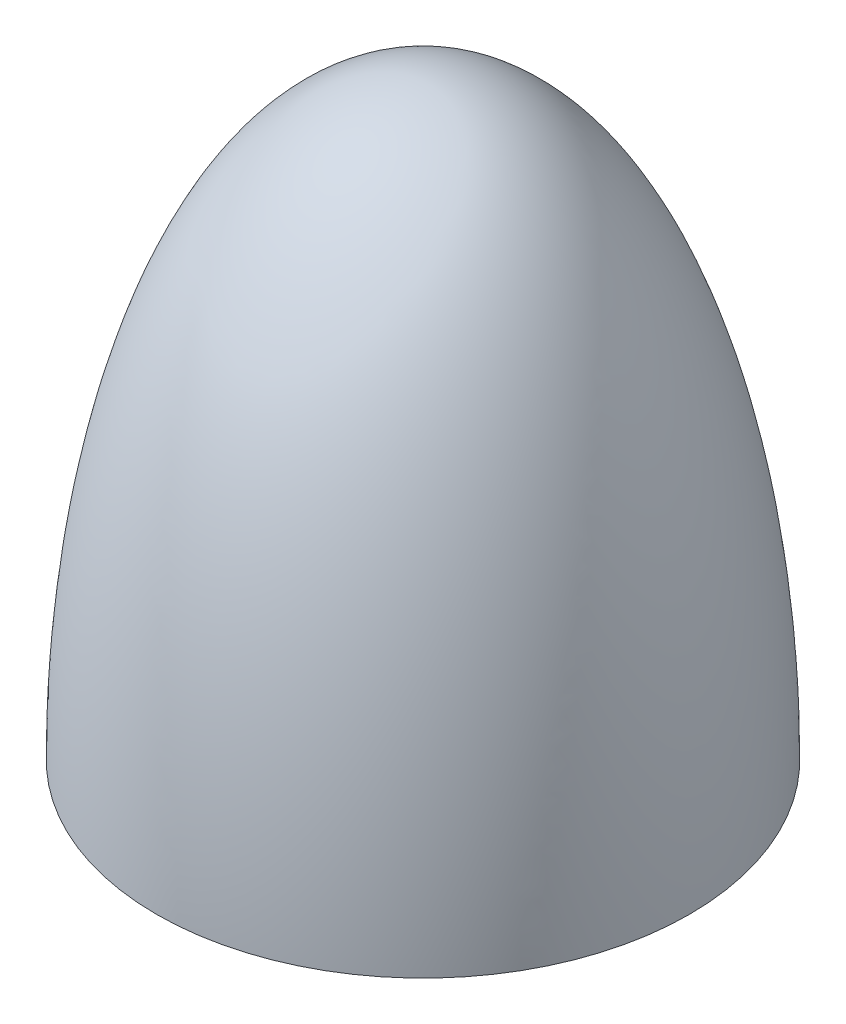
ISO-10303-21;
HEADER;
FILE_DESCRIPTION(('STEP AP214'),'2;1');
FILE_NAME('part.step','',(''),(''),'','','');
FILE_SCHEMA(('AUTOMOTIVE_DESIGN { 1 0 10303 214 1 1 1 1 }'));
ENDSEC;
DATA;
#1=APPLICATION_CONTEXT('core data for automotive mechanical design processes');
#2=APPLICATION_PROTOCOL_DEFINITION('international standard','automotive_design',2000,#1);
#3=PRODUCT_CONTEXT('',#1,'mechanical');
#4=PRODUCT('Part','Part','',(#3));
#5=PRODUCT_RELATED_PRODUCT_CATEGORY('part','',(#4));
#6=PRODUCT_DEFINITION_FORMATION('','',#4);
#7=PRODUCT_DEFINITION_CONTEXT('part definition',#1,'design');
#8=PRODUCT_DEFINITION('design','',#6,#7);
#9=PRODUCT_DEFINITION_SHAPE('','',#8);
#10=(LENGTH_UNIT() NAMED_UNIT(*) SI_UNIT(.MILLI.,.METRE.));
#11=(NAMED_UNIT(*) PLANE_ANGLE_UNIT() SI_UNIT($,.RADIAN.));
#12=(NAMED_UNIT(*) SI_UNIT($,.STERADIAN.) SOLID_ANGLE_UNIT());
#13=UNCERTAINTY_MEASURE_WITH_UNIT(LENGTH_MEASURE(1.E-05),#10,'distance_accuracy_value','');
#14=(GEOMETRIC_REPRESENTATION_CONTEXT(3) GLOBAL_UNCERTAINTY_ASSIGNED_CONTEXT((#13)) GLOBAL_UNIT_ASSIGNED_CONTEXT((#10,
#11,#12)) REPRESENTATION_CONTEXT('',''));
#15=CARTESIAN_POINT('',(0.,0.,0.));
#16=DIRECTION('',(0.,0.,1.));
#17=DIRECTION('',(1.,0.,0.));
#18=AXIS2_PLACEMENT_3D('',#15,#16,#17);
#19=CARTESIAN_POINT('',(0.,0.,0.));
#20=DIRECTION('',(0.,0.,-1.));
#21=DIRECTION('',(0.,1.,0.));
#22=AXIS2_PLACEMENT_3D('',#19,#20,#21);
#23=ELLIPSE('',#22,20.,8.);
#24=TRIMMED_CURVE('',#23,(PARAMETER_VALUE(0.)),(PARAMETER_VALUE(3.14159265358979)),.T.,.PARAMETER.);
#25=CARTESIAN_POINT('',(0.,20.,0.));
#26=DIRECTION('',(0.,-1.,0.));
#27=AXIS1_PLACEMENT('',#25,#26);
#28=SURFACE_OF_REVOLUTION('',#24,#27);
#29=CARTESIAN_POINT('',(0.,0.,0.));
#30=DIRECTION('',(0.,-1.,0.));
#31=DIRECTION('',(0.,0.,-1.));
#32=AXIS2_PLACEMENT_3D('',#29,#30,#31);
#33=CIRCLE('',#32,8.);
#34=CARTESIAN_POINT('',(0.,0.,-8.));
#35=VERTEX_POINT('',#34);
#36=EDGE_CURVE('E11',#35,#35,#33,.T.);
#37=ORIENTED_EDGE('',*,*,#36,.T.);
#38=EDGE_LOOP('',(#37));
#39=FACE_BOUND('',#38,.T.);
#40=CARTESIAN_POINT('',(0.,20.,0.));
#41=VERTEX_POINT('',#40);
#42=VERTEX_LOOP('',#41);
#43=FACE_BOUND('',#42,.T.);
#44=ADVANCED_FACE('F37',(#39,#43),#28,.F.);
#45=CARTESIAN_POINT('',(8.,0.,0.));
#46=DIRECTION('',(0.,-1.,0.));
#47=DIRECTION('',(0.,0.,-1.));
#48=AXIS2_PLACEMENT_3D('',#45,#46,#47);
#49=PLANE('',#48);
#50=CARTESIAN_POINT('',(0.,0.,0.));
#51=DIRECTION('',(0.,-1.,0.));
#52=DIRECTION('',(0.,0.,-1.));
#53=AXIS2_PLACEMENT_3D('',#50,#51,#52);
#54=CIRCLE('',#53,10.);
#55=CARTESIAN_POINT('',(0.,0.,-10.));
#56=VERTEX_POINT('',#55);
#57=EDGE_CURVE('E45',#56,#56,#54,.T.);
#58=ORIENTED_EDGE('',*,*,#57,.T.);
#59=EDGE_LOOP('',(#58));
#60=FACE_BOUND('',#59,.T.);
#61=ORIENTED_EDGE('',*,*,#36,.F.);
#62=EDGE_LOOP('',(#61));
#63=FACE_BOUND('',#62,.T.);
#64=ADVANCED_FACE('F54',(#60,#63),#49,.T.);
#65=CARTESIAN_POINT('',(10.,0.,0.));
#66=CARTESIAN_POINT('',(9.99999999999924,0.680678408258449,0.));
#67=CARTESIAN_POINT('',(9.94652465487736,3.40339204134994,0.));
#68=CARTESIAN_POINT('',(9.41177120367182,8.75459921297821,0.));
#69=CARTESIAN_POINT('',(8.00999431879703,14.0395280334975,0.));
#70=CARTESIAN_POINT('',(6.20992828177802,17.7501234889305,0.));
#71=CARTESIAN_POINT('',(4.56375739894859,19.9723499814914,0.));
#72=CARTESIAN_POINT('',(2.5359389293359,21.5619059688831,0.));
#73=CARTESIAN_POINT('',(0.845312976445299,21.999999999942,0.));
#74=CARTESIAN_POINT('',(0.,21.999999999942,0.));
#75=B_SPLINE_CURVE_WITH_KNOTS('',3,(#65,#66,#67,#68,#69,#70,#71,#72,#73,#74),.UNSPECIFIED.,.F.,
.F.,(4,1,1,1,1,1,1,4),(4.71238898038748,4.81056375080937,5.10508806208341,5.49778714378214,
5.6941366846315,5.89048622548086,6.08683576633022,6.28318530717959),.UNSPECIFIED.);
#76=CARTESIAN_POINT('',(0.,20.,0.));
#77=DIRECTION('',(0.,-1.,0.));
#78=AXIS1_PLACEMENT('',#76,#77);
#79=SURFACE_OF_REVOLUTION('',#75,#78);
#80=CARTESIAN_POINT('',(0.,21.999999999942,0.));
#81=VERTEX_POINT('',#80);
#82=VERTEX_LOOP('',#81);
#83=FACE_BOUND('',#82,.T.);
#84=ORIENTED_EDGE('',*,*,#57,.F.);
#85=EDGE_LOOP('',(#84));
#86=FACE_BOUND('',#85,.T.);
#87=ADVANCED_FACE('F51',(#83,#86),#79,.F.);
#88=CLOSED_SHELL('',(#44,#64,#87));
#89=MANIFOLD_SOLID_BREP('B2',#88);
#90=ADVANCED_BREP_SHAPE_REPRESENTATION('',(#18,#89),#14);
#91=SHAPE_DEFINITION_REPRESENTATION(#9,#90);
ENDSEC;
END-ISO-10303-21;
